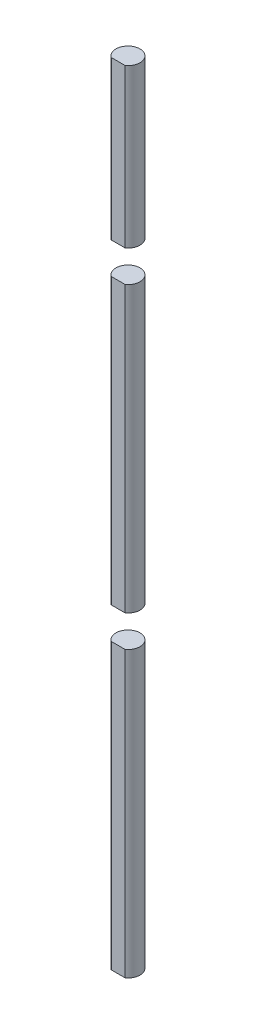
ISO-10303-21;
HEADER;
FILE_DESCRIPTION(('STEP AP214'),'2;1');
FILE_NAME('part.step','',(''),(''),'','','');
FILE_SCHEMA(('AUTOMOTIVE_DESIGN { 1 0 10303 214 1 1 1 1 }'));
ENDSEC;
DATA;
#1=APPLICATION_CONTEXT('core data for automotive mechanical design processes');
#2=APPLICATION_PROTOCOL_DEFINITION('international standard','automotive_design',2000,#1);
#3=PRODUCT_CONTEXT('',#1,'mechanical');
#4=PRODUCT('Part','Part','',(#3));
#5=PRODUCT_RELATED_PRODUCT_CATEGORY('part','',(#4));
#6=PRODUCT_DEFINITION_FORMATION('','',#4);
#7=PRODUCT_DEFINITION_CONTEXT('part definition',#1,'design');
#8=PRODUCT_DEFINITION('design','',#6,#7);
#9=PRODUCT_DEFINITION_SHAPE('','',#8);
#10=(LENGTH_UNIT() NAMED_UNIT(*) SI_UNIT(.MILLI.,.METRE.));
#11=(NAMED_UNIT(*) PLANE_ANGLE_UNIT() SI_UNIT($,.RADIAN.));
#12=(NAMED_UNIT(*) SI_UNIT($,.STERADIAN.) SOLID_ANGLE_UNIT());
#13=UNCERTAINTY_MEASURE_WITH_UNIT(LENGTH_MEASURE(1.E-05),#10,'distance_accuracy_value','');
#14=(GEOMETRIC_REPRESENTATION_CONTEXT(3) GLOBAL_UNCERTAINTY_ASSIGNED_CONTEXT((#13)) GLOBAL_UNIT_ASSIGNED_CONTEXT((#10,
#11,#12)) REPRESENTATION_CONTEXT('',''));
#15=CARTESIAN_POINT('',(0.,0.,0.));
#16=DIRECTION('',(0.,0.,1.));
#17=DIRECTION('',(1.,0.,0.));
#18=AXIS2_PLACEMENT_3D('',#15,#16,#17);
#19=CARTESIAN_POINT('',(0.,130.,0.));
#20=DIRECTION('',(0.,-1.,0.));
#21=DIRECTION('',(0.,0.,-1.));
#22=AXIS2_PLACEMENT_3D('',#19,#20,#21);
#23=CYLINDRICAL_SURFACE('',#22,1.9);
#24=DIRECTION('',(0.,-1.,0.));
#25=VECTOR('',#24,1.);
#26=CARTESIAN_POINT('',(-1.09331067388553,130.,1.55392141705042));
#27=LINE('',#26,#25);
#28=CARTESIAN_POINT('',(-1.09331067388553,125.,1.55392141705042));
#29=VERTEX_POINT('',#28);
#30=CARTESIAN_POINT('',(-1.09331067388553,100.,1.55392141705042));
#31=VERTEX_POINT('',#30);
#32=EDGE_CURVE('E47',#29,#31,#27,.T.);
#33=ORIENTED_EDGE('',*,*,#32,.F.);
#34=CARTESIAN_POINT('',(0.,125.,0.));
#35=DIRECTION('',(0.,-1.,0.));
#36=DIRECTION('',(0.,0.,-1.));
#37=AXIS2_PLACEMENT_3D('',#34,#35,#36);
#38=CIRCLE('',#37,1.9);
#39=CARTESIAN_POINT('',(1.09331067388553,125.,1.55392141705042));
#40=VERTEX_POINT('',#39);
#41=EDGE_CURVE('E59',#29,#40,#38,.T.);
#42=ORIENTED_EDGE('',*,*,#41,.T.);
#43=DIRECTION('',(0.,-1.,0.));
#44=VECTOR('',#43,1.);
#45=CARTESIAN_POINT('',(1.09331067388553,130.,1.55392141705042));
#46=LINE('',#45,#44);
#47=CARTESIAN_POINT('',(1.09331067388553,100.,1.55392141705042));
#48=VERTEX_POINT('',#47);
#49=EDGE_CURVE('E78',#40,#48,#46,.T.);
#50=ORIENTED_EDGE('',*,*,#49,.T.);
#51=CARTESIAN_POINT('',(0.,100.,0.));
#52=DIRECTION('',(0.,-1.,0.));
#53=DIRECTION('',(0.,0.,-1.));
#54=AXIS2_PLACEMENT_3D('',#51,#52,#53);
#55=CIRCLE('',#54,1.9);
#56=EDGE_CURVE('E70',#31,#48,#55,.T.);
#57=ORIENTED_EDGE('',*,*,#56,.F.);
#58=EDGE_LOOP('',(#33,#42,#50,#57));
#59=FACE_BOUND('',#58,.T.);
#60=ADVANCED_FACE('F44',(#59),#23,.T.);
#61=CARTESIAN_POINT('',(-1.09331067388553,130.,1.55392141705042));
#62=DIRECTION('',(0.,0.,-1.));
#63=DIRECTION('',(-1.,0.,0.));
#64=AXIS2_PLACEMENT_3D('',#61,#62,#63);
#65=PLANE('',#64);
#66=ORIENTED_EDGE('',*,*,#49,.F.);
#67=DIRECTION('',(1.,0.,0.));
#68=VECTOR('',#67,1.);
#69=CARTESIAN_POINT('',(0.,125.,1.55392141705042));
#70=LINE('',#69,#68);
#71=EDGE_CURVE('E12',#29,#40,#70,.T.);
#72=ORIENTED_EDGE('',*,*,#71,.F.);
#73=ORIENTED_EDGE('',*,*,#32,.T.);
#74=DIRECTION('',(-1.,0.,0.));
#75=VECTOR('',#74,1.);
#76=CARTESIAN_POINT('',(-1.09331067388553,100.,1.55392141705042));
#77=LINE('',#76,#75);
#78=EDGE_CURVE('E53',#48,#31,#77,.T.);
#79=ORIENTED_EDGE('',*,*,#78,.F.);
#80=EDGE_LOOP('',(#66,#72,#73,#79));
#81=FACE_BOUND('',#80,.T.);
#82=ADVANCED_FACE('F80',(#81),#65,.F.);
#83=CARTESIAN_POINT('',(0.,100.,-128.44607858295));
#84=DIRECTION('',(0.,-1.,0.));
#85=DIRECTION('',(0.,0.,-1.));
#86=AXIS2_PLACEMENT_3D('',#83,#84,#85);
#87=PLANE('',#86);
#88=ORIENTED_EDGE('',*,*,#56,.T.);
#89=ORIENTED_EDGE('',*,*,#78,.T.);
#90=EDGE_LOOP('',(#88,#89));
#91=FACE_BOUND('',#90,.T.);
#92=ADVANCED_FACE('F69',(#91),#87,.T.);
#93=CARTESIAN_POINT('',(0.,125.,-128.44607858295));
#94=DIRECTION('',(0.,-1.,0.));
#95=DIRECTION('',(0.,0.,-1.));
#96=AXIS2_PLACEMENT_3D('',#93,#94,#95);
#97=PLANE('',#96);
#98=ORIENTED_EDGE('',*,*,#71,.T.);
#99=ORIENTED_EDGE('',*,*,#41,.F.);
#100=EDGE_LOOP('',(#98,#99));
#101=FACE_BOUND('',#100,.T.);
#102=ADVANCED_FACE('F82',(#101),#97,.F.);
#103=CLOSED_SHELL('',(#60,#82,#92,#102));
#104=MANIFOLD_SOLID_BREP('B2',#103);
#105=CARTESIAN_POINT('',(0.,0.,0.));
#106=DIRECTION('',(0.,1.,0.));
#107=DIRECTION('',(0.,0.,1.));
#108=AXIS2_PLACEMENT_3D('',#105,#106,#107);
#109=PLANE('',#108);
#110=CARTESIAN_POINT('',(0.,0.,0.));
#111=DIRECTION('',(0.,1.,0.));
#112=DIRECTION('',(0.,0.,1.));
#113=AXIS2_PLACEMENT_3D('',#110,#111,#112);
#114=CIRCLE('',#113,1.9);
#115=CARTESIAN_POINT('',(1.09331067388553,0.,1.55392141705042));
#116=VERTEX_POINT('',#115);
#117=CARTESIAN_POINT('',(-1.09331067388553,0.,1.55392141705042));
#118=VERTEX_POINT('',#117);
#119=EDGE_CURVE('E42',#116,#118,#114,.T.);
#120=ORIENTED_EDGE('',*,*,#119,.F.);
#121=DIRECTION('',(1.,0.,0.));
#122=VECTOR('',#121,1.);
#123=CARTESIAN_POINT('',(-1.09331067388553,0.,1.55392141705042));
#124=LINE('',#123,#122);
#125=EDGE_CURVE('E155',#118,#116,#124,.T.);
#126=ORIENTED_EDGE('',*,*,#125,.F.);
#127=EDGE_LOOP('',(#120,#126));
#128=FACE_BOUND('',#127,.T.);
#129=ADVANCED_FACE('F125',(#128),#109,.F.);
#130=CARTESIAN_POINT('',(-1.09331067388553,130.,1.55392141705042));
#131=DIRECTION('',(0.,0.,-1.));
#132=DIRECTION('',(-1.,0.,0.));
#133=AXIS2_PLACEMENT_3D('',#130,#131,#132);
#134=PLANE('',#133);
#135=DIRECTION('',(0.,-1.,0.));
#136=VECTOR('',#135,1.);
#137=CARTESIAN_POINT('',(1.09331067388553,130.,1.55392141705042));
#138=LINE('',#137,#136);
#139=CARTESIAN_POINT('',(1.09331067388553,45.,1.55392141705042));
#140=VERTEX_POINT('',#139);
#141=EDGE_CURVE('E129',#140,#116,#138,.T.);
#142=ORIENTED_EDGE('',*,*,#141,.F.);
#143=DIRECTION('',(-1.,0.,0.));
#144=VECTOR('',#143,1.);
#145=CARTESIAN_POINT('',(-1.09331067388553,45.,1.55392141705042));
#146=LINE('',#145,#144);
#147=CARTESIAN_POINT('',(-1.09331067388553,45.,1.55392141705042));
#148=VERTEX_POINT('',#147);
#149=EDGE_CURVE('E157',#140,#148,#146,.T.);
#150=ORIENTED_EDGE('',*,*,#149,.T.);
#151=DIRECTION('',(0.,-1.,0.));
#152=VECTOR('',#151,1.);
#153=CARTESIAN_POINT('',(-1.09331067388553,130.,1.55392141705042));
#154=LINE('',#153,#152);
#155=EDGE_CURVE('E151',#148,#118,#154,.T.);
#156=ORIENTED_EDGE('',*,*,#155,.T.);
#157=ORIENTED_EDGE('',*,*,#125,.T.);
#158=EDGE_LOOP('',(#142,#150,#156,#157));
#159=FACE_BOUND('',#158,.T.);
#160=ADVANCED_FACE('F154',(#159),#134,.F.);
#161=CARTESIAN_POINT('',(0.,130.,0.));
#162=DIRECTION('',(0.,-1.,0.));
#163=DIRECTION('',(0.,0.,-1.));
#164=AXIS2_PLACEMENT_3D('',#161,#162,#163);
#165=CYLINDRICAL_SURFACE('',#164,1.9);
#166=ORIENTED_EDGE('',*,*,#155,.F.);
#167=CARTESIAN_POINT('',(0.,45.,0.));
#168=DIRECTION('',(0.,-1.,0.));
#169=DIRECTION('',(0.,0.,-1.));
#170=AXIS2_PLACEMENT_3D('',#167,#168,#169);
#171=CIRCLE('',#170,1.9);
#172=EDGE_CURVE('E141',#148,#140,#171,.T.);
#173=ORIENTED_EDGE('',*,*,#172,.T.);
#174=ORIENTED_EDGE('',*,*,#141,.T.);
#175=ORIENTED_EDGE('',*,*,#119,.T.);
#176=EDGE_LOOP('',(#166,#173,#174,#175));
#177=FACE_BOUND('',#176,.T.);
#178=ADVANCED_FACE('F127',(#177),#165,.T.);
#179=CARTESIAN_POINT('',(0.,45.,-128.44607858295));
#180=DIRECTION('',(0.,-1.,0.));
#181=DIRECTION('',(0.,0.,-1.));
#182=AXIS2_PLACEMENT_3D('',#179,#180,#181);
#183=PLANE('',#182);
#184=ORIENTED_EDGE('',*,*,#149,.F.);
#185=ORIENTED_EDGE('',*,*,#172,.F.);
#186=EDGE_LOOP('',(#184,#185));
#187=FACE_BOUND('',#186,.T.);
#188=ADVANCED_FACE('F164',(#187),#183,.F.);
#189=CLOSED_SHELL('',(#129,#160,#178,#188));
#190=MANIFOLD_SOLID_BREP('B6',#189);
#191=CARTESIAN_POINT('',(-1.09331067388553,130.,1.55392141705042));
#192=DIRECTION('',(0.,0.,-1.));
#193=DIRECTION('',(-1.,0.,0.));
#194=AXIS2_PLACEMENT_3D('',#191,#192,#193);
#195=PLANE('',#194);
#196=DIRECTION('',(0.,-1.,0.));
#197=VECTOR('',#196,1.);
#198=CARTESIAN_POINT('',(1.09331067388553,130.,1.55392141705042));
#199=LINE('',#198,#197);
#200=CARTESIAN_POINT('',(1.09331067388553,95.,1.55392141705042));
#201=VERTEX_POINT('',#200);
#202=CARTESIAN_POINT('',(1.09331067388553,50.,1.55392141705042));
#203=VERTEX_POINT('',#202);
#204=EDGE_CURVE('E230',#201,#203,#199,.T.);
#205=ORIENTED_EDGE('',*,*,#204,.F.);
#206=DIRECTION('',(-1.,0.,0.));
#207=VECTOR('',#206,1.);
#208=CARTESIAN_POINT('',(-1.09331067388553,95.,1.55392141705042));
#209=LINE('',#208,#207);
#210=CARTESIAN_POINT('',(-1.09331067388553,95.,1.55392141705042));
#211=VERTEX_POINT('',#210);
#212=EDGE_CURVE('E123',#201,#211,#209,.T.);
#213=ORIENTED_EDGE('',*,*,#212,.T.);
#214=DIRECTION('',(0.,-1.,0.));
#215=VECTOR('',#214,1.);
#216=CARTESIAN_POINT('',(-1.09331067388553,130.,1.55392141705042));
#217=LINE('',#216,#215);
#218=CARTESIAN_POINT('',(-1.09331067388553,50.,1.55392141705042));
#219=VERTEX_POINT('',#218);
#220=EDGE_CURVE('E227',#211,#219,#217,.T.);
#221=ORIENTED_EDGE('',*,*,#220,.T.);
#222=DIRECTION('',(-1.,0.,0.));
#223=VECTOR('',#222,1.);
#224=CARTESIAN_POINT('',(-1.09331067388553,50.,1.55392141705042));
#225=LINE('',#224,#223);
#226=EDGE_CURVE('E205',#203,#219,#225,.T.);
#227=ORIENTED_EDGE('',*,*,#226,.F.);
#228=EDGE_LOOP('',(#205,#213,#221,#227));
#229=FACE_BOUND('',#228,.T.);
#230=ADVANCED_FACE('F197',(#229),#195,.F.);
#231=CARTESIAN_POINT('',(0.,130.,0.));
#232=DIRECTION('',(0.,-1.,0.));
#233=DIRECTION('',(0.,0.,-1.));
#234=AXIS2_PLACEMENT_3D('',#231,#232,#233);
#235=CYLINDRICAL_SURFACE('',#234,1.9);
#236=ORIENTED_EDGE('',*,*,#220,.F.);
#237=CARTESIAN_POINT('',(0.,95.,0.));
#238=DIRECTION('',(0.,-1.,0.));
#239=DIRECTION('',(0.,0.,-1.));
#240=AXIS2_PLACEMENT_3D('',#237,#238,#239);
#241=CIRCLE('',#240,1.9);
#242=EDGE_CURVE('E211',#211,#201,#241,.T.);
#243=ORIENTED_EDGE('',*,*,#242,.T.);
#244=ORIENTED_EDGE('',*,*,#204,.T.);
#245=CARTESIAN_POINT('',(0.,50.,0.));
#246=DIRECTION('',(0.,-1.,0.));
#247=DIRECTION('',(0.,0.,-1.));
#248=AXIS2_PLACEMENT_3D('',#245,#246,#247);
#249=CIRCLE('',#248,1.9);
#250=EDGE_CURVE('E217',#219,#203,#249,.T.);
#251=ORIENTED_EDGE('',*,*,#250,.F.);
#252=EDGE_LOOP('',(#236,#243,#244,#251));
#253=FACE_BOUND('',#252,.T.);
#254=ADVANCED_FACE('F199',(#253),#235,.T.);
#255=CARTESIAN_POINT('',(0.,50.,-128.44607858295));
#256=DIRECTION('',(0.,-1.,0.));
#257=DIRECTION('',(0.,0.,-1.));
#258=AXIS2_PLACEMENT_3D('',#255,#256,#257);
#259=PLANE('',#258);
#260=ORIENTED_EDGE('',*,*,#250,.T.);
#261=ORIENTED_EDGE('',*,*,#226,.T.);
#262=EDGE_LOOP('',(#260,#261));
#263=FACE_BOUND('',#262,.T.);
#264=ADVANCED_FACE('F222',(#263),#259,.T.);
#265=CARTESIAN_POINT('',(0.,95.,-128.44607858295));
#266=DIRECTION('',(0.,-1.,0.));
#267=DIRECTION('',(0.,0.,-1.));
#268=AXIS2_PLACEMENT_3D('',#265,#266,#267);
#269=PLANE('',#268);
#270=ORIENTED_EDGE('',*,*,#212,.F.);
#271=ORIENTED_EDGE('',*,*,#242,.F.);
#272=EDGE_LOOP('',(#270,#271));
#273=FACE_BOUND('',#272,.T.);
#274=ADVANCED_FACE('F235',(#273),#269,.F.);
#275=CLOSED_SHELL('',(#230,#254,#264,#274));
#276=MANIFOLD_SOLID_BREP('B36',#275);
#277=ADVANCED_BREP_SHAPE_REPRESENTATION('',(#18,#104,#190,#276),#14);
#278=SHAPE_DEFINITION_REPRESENTATION(#9,#277);
ENDSEC;
END-ISO-10303-21;
